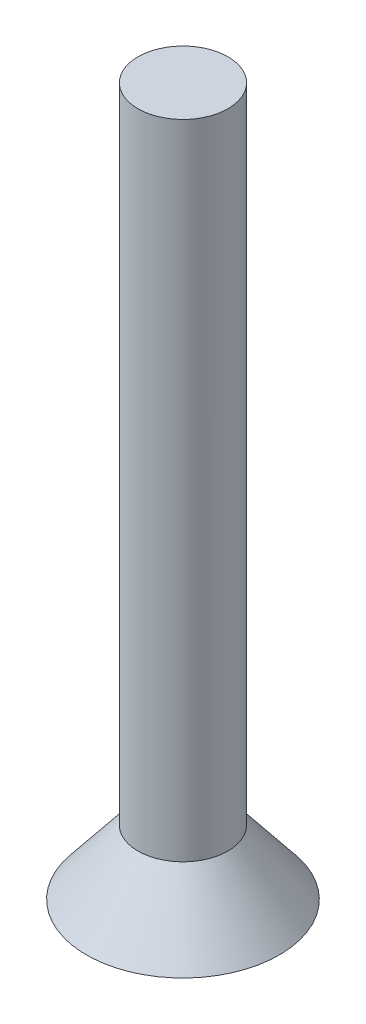
ISO-10303-21;
HEADER;
FILE_DESCRIPTION(('STEP AP214'),'2;1');
FILE_NAME('part.step','',(''),(''),'','','');
FILE_SCHEMA(('AUTOMOTIVE_DESIGN { 1 0 10303 214 1 1 1 1 }'));
ENDSEC;
DATA;
#1=APPLICATION_CONTEXT('core data for automotive mechanical design processes');
#2=APPLICATION_PROTOCOL_DEFINITION('international standard','automotive_design',2000,#1);
#3=PRODUCT_CONTEXT('',#1,'mechanical');
#4=PRODUCT('Part','Part','',(#3));
#5=PRODUCT_RELATED_PRODUCT_CATEGORY('part','',(#4));
#6=PRODUCT_DEFINITION_FORMATION('','',#4);
#7=PRODUCT_DEFINITION_CONTEXT('part definition',#1,'design');
#8=PRODUCT_DEFINITION('design','',#6,#7);
#9=PRODUCT_DEFINITION_SHAPE('','',#8);
#10=(LENGTH_UNIT() NAMED_UNIT(*) SI_UNIT(.MILLI.,.METRE.));
#11=(NAMED_UNIT(*) PLANE_ANGLE_UNIT() SI_UNIT($,.RADIAN.));
#12=(NAMED_UNIT(*) SI_UNIT($,.STERADIAN.) SOLID_ANGLE_UNIT());
#13=UNCERTAINTY_MEASURE_WITH_UNIT(LENGTH_MEASURE(1.E-05),#10,'distance_accuracy_value','');
#14=(GEOMETRIC_REPRESENTATION_CONTEXT(3) GLOBAL_UNCERTAINTY_ASSIGNED_CONTEXT((#13)) GLOBAL_UNIT_ASSIGNED_CONTEXT((#10,
#11,#12)) REPRESENTATION_CONTEXT('',''));
#15=CARTESIAN_POINT('',(0.,0.,0.));
#16=DIRECTION('',(0.,0.,1.));
#17=DIRECTION('',(1.,0.,0.));
#18=AXIS2_PLACEMENT_3D('',#15,#16,#17);
#19=CARTESIAN_POINT('',(0.,0.,0.));
#20=DIRECTION('',(0.,-1.,0.));
#21=DIRECTION('',(0.,0.,-1.));
#22=AXIS2_PLACEMENT_3D('',#19,#20,#21);
#23=CONICAL_SURFACE('',#22,1.5,0.674740942223554);
#24=CARTESIAN_POINT('',(0.,1.,0.));
#25=DIRECTION('',(0.,1.,0.));
#26=DIRECTION('',(0.,0.,1.));
#27=AXIS2_PLACEMENT_3D('',#24,#25,#26);
#28=CIRCLE('',#27,0.7);
#29=CARTESIAN_POINT('',(0.,1.,0.7));
#30=VERTEX_POINT('',#29);
#31=EDGE_CURVE('E212',#30,#30,#28,.T.);
#32=ORIENTED_EDGE('',*,*,#31,.F.);
#33=EDGE_LOOP('',(#32));
#34=FACE_BOUND('',#33,.T.);
#35=CARTESIAN_POINT('',(0.,0.,0.));
#36=DIRECTION('',(0.,-1.,0.));
#37=DIRECTION('',(0.,0.,-1.));
#38=AXIS2_PLACEMENT_3D('',#35,#36,#37);
#39=CIRCLE('',#38,1.5);
#40=CARTESIAN_POINT('',(0.,0.,-1.5));
#41=VERTEX_POINT('',#40);
#42=EDGE_CURVE('E11',#41,#41,#39,.T.);
#43=ORIENTED_EDGE('',*,*,#42,.F.);
#44=EDGE_LOOP('',(#43));
#45=FACE_BOUND('',#44,.T.);
#46=ADVANCED_FACE('F39',(#34,#45),#23,.T.);
#47=CARTESIAN_POINT('',(0.,0.,0.));
#48=DIRECTION('',(0.,-1.,0.));
#49=DIRECTION('',(0.,0.,-1.));
#50=AXIS2_PLACEMENT_3D('',#47,#48,#49);
#51=PLANE('',#50);
#52=DIRECTION('',(1.,0.,0.));
#53=VECTOR('',#52,1.);
#54=CARTESIAN_POINT('',(0.765105952763958,0.,-0.249999999999995));
#55=LINE('',#54,#53);
#56=CARTESIAN_POINT('',(0.250000000000001,0.,-0.249999999999998));
#57=VERTEX_POINT('',#56);
#58=CARTESIAN_POINT('',(0.765105952763958,0.,-0.249999999999995));
#59=VERTEX_POINT('',#58);
#60=EDGE_CURVE('E54',#57,#59,#55,.T.);
#61=ORIENTED_EDGE('',*,*,#60,.F.);
#62=DIRECTION('',(0.,0.,1.));
#63=VECTOR('',#62,1.);
#64=CARTESIAN_POINT('',(0.250000000000001,0.,-0.249999999999998));
#65=LINE('',#64,#63);
#66=CARTESIAN_POINT('',(0.250000000000003,0.,-0.765105952763955));
#67=VERTEX_POINT('',#66);
#68=EDGE_CURVE('E206',#67,#57,#65,.T.);
#69=ORIENTED_EDGE('',*,*,#68,.F.);
#70=DIRECTION('',(1.,0.,0.));
#71=VECTOR('',#70,1.);
#72=CARTESIAN_POINT('',(0.,0.,-0.765105952763956));
#73=LINE('',#72,#71);
#74=CARTESIAN_POINT('',(-0.249999999999997,0.,-0.765105952763957));
#75=VERTEX_POINT('',#74);
#76=EDGE_CURVE('E203',#75,#67,#73,.T.);
#77=ORIENTED_EDGE('',*,*,#76,.F.);
#78=DIRECTION('',(0.,0.,-1.));
#79=VECTOR('',#78,1.);
#80=CARTESIAN_POINT('',(-0.249999999999997,0.,-0.765105952763957));
#81=LINE('',#80,#79);
#82=CARTESIAN_POINT('',(-0.249999999999999,0.,-0.25));
#83=VERTEX_POINT('',#82);
#84=EDGE_CURVE('E138',#83,#75,#81,.T.);
#85=ORIENTED_EDGE('',*,*,#84,.F.);
#86=DIRECTION('',(1.,0.,0.));
#87=VECTOR('',#86,1.);
#88=CARTESIAN_POINT('',(-0.249999999999999,0.,-0.25));
#89=LINE('',#88,#87);
#90=CARTESIAN_POINT('',(-0.765105952763956,0.,-0.25));
#91=VERTEX_POINT('',#90);
#92=EDGE_CURVE('E197',#91,#83,#89,.T.);
#93=ORIENTED_EDGE('',*,*,#92,.F.);
#94=DIRECTION('',(0.,0.,-1.));
#95=VECTOR('',#94,1.);
#96=CARTESIAN_POINT('',(-0.765105952763956,0.,0.));
#97=LINE('',#96,#95);
#98=CARTESIAN_POINT('',(-0.765105952763956,0.,0.25));
#99=VERTEX_POINT('',#98);
#100=EDGE_CURVE('E193',#99,#91,#97,.T.);
#101=ORIENTED_EDGE('',*,*,#100,.F.);
#102=DIRECTION('',(-1.,0.,0.));
#103=VECTOR('',#102,1.);
#104=CARTESIAN_POINT('',(-0.765105952763956,0.,0.25));
#105=LINE('',#104,#103);
#106=CARTESIAN_POINT('',(-0.250000000000003,0.,0.25));
#107=VERTEX_POINT('',#106);
#108=EDGE_CURVE('E189',#107,#99,#105,.T.);
#109=ORIENTED_EDGE('',*,*,#108,.F.);
#110=DIRECTION('',(0.,0.,-1.));
#111=VECTOR('',#110,1.);
#112=CARTESIAN_POINT('',(-0.250000000000003,0.,0.25));
#113=LINE('',#112,#111);
#114=CARTESIAN_POINT('',(-0.250000000000008,0.,0.765105952763953));
#115=VERTEX_POINT('',#114);
#116=EDGE_CURVE('E185',#115,#107,#113,.T.);
#117=ORIENTED_EDGE('',*,*,#116,.F.);
#118=DIRECTION('',(-1.,0.,0.));
#119=VECTOR('',#118,1.);
#120=CARTESIAN_POINT('',(0.,0.,0.765105952763956));
#121=LINE('',#120,#119);
#122=CARTESIAN_POINT('',(0.249999999999992,0.,0.765105952763959));
#123=VERTEX_POINT('',#122);
#124=EDGE_CURVE('E181',#123,#115,#121,.T.);
#125=ORIENTED_EDGE('',*,*,#124,.F.);
#126=DIRECTION('',(0.,0.,1.));
#127=VECTOR('',#126,1.);
#128=CARTESIAN_POINT('',(0.249999999999992,0.,0.765105952763959));
#129=LINE('',#128,#127);
#130=CARTESIAN_POINT('',(0.249999999999997,0.,0.250000000000002));
#131=VERTEX_POINT('',#130);
#132=EDGE_CURVE('E177',#131,#123,#129,.T.);
#133=ORIENTED_EDGE('',*,*,#132,.F.);
#134=DIRECTION('',(-1.,0.,0.));
#135=VECTOR('',#134,1.);
#136=CARTESIAN_POINT('',(0.249999999999997,0.,0.250000000000002));
#137=LINE('',#136,#135);
#138=CARTESIAN_POINT('',(0.765105952763954,0.,0.250000000000005));
#139=VERTEX_POINT('',#138);
#140=EDGE_CURVE('E173',#139,#131,#137,.T.);
#141=ORIENTED_EDGE('',*,*,#140,.F.);
#142=DIRECTION('',(0.,0.,1.));
#143=VECTOR('',#142,1.);
#144=CARTESIAN_POINT('',(0.765105952763956,0.,0.));
#145=LINE('',#144,#143);
#146=EDGE_CURVE('E169',#59,#139,#145,.T.);
#147=ORIENTED_EDGE('',*,*,#146,.F.);
#148=EDGE_LOOP('',(#61,#69,#77,#85,#93,#101,#109,#117,#125,#133,#141,#147));
#149=FACE_BOUND('',#148,.T.);
#150=ORIENTED_EDGE('',*,*,#42,.T.);
#151=EDGE_LOOP('',(#150));
#152=FACE_BOUND('',#151,.T.);
#153=ADVANCED_FACE('F250',(#149,#152),#51,.T.);
#154=CARTESIAN_POINT('',(0.,11.,0.));
#155=DIRECTION('',(0.,-1.,0.));
#156=DIRECTION('',(0.,0.,-1.));
#157=AXIS2_PLACEMENT_3D('',#154,#155,#156);
#158=CYLINDRICAL_SURFACE('',#157,0.7);
#159=CARTESIAN_POINT('',(0.,11.,0.));
#160=DIRECTION('',(0.,1.,0.));
#161=DIRECTION('',(0.,0.,1.));
#162=AXIS2_PLACEMENT_3D('',#159,#160,#161);
#163=CIRCLE('',#162,0.7);
#164=CARTESIAN_POINT('',(0.,11.,0.7));
#165=VERTEX_POINT('',#164);
#166=EDGE_CURVE('E47',#165,#165,#163,.T.);
#167=ORIENTED_EDGE('',*,*,#166,.F.);
#168=EDGE_LOOP('',(#167));
#169=FACE_BOUND('',#168,.T.);
#170=ORIENTED_EDGE('',*,*,#31,.T.);
#171=EDGE_LOOP('',(#170));
#172=FACE_BOUND('',#171,.T.);
#173=ADVANCED_FACE('F246',(#169,#172),#158,.T.);
#174=CARTESIAN_POINT('',(0.,11.,0.));
#175=DIRECTION('',(0.,1.,0.));
#176=DIRECTION('',(0.,0.,1.));
#177=AXIS2_PLACEMENT_3D('',#174,#175,#176);
#178=PLANE('',#177);
#179=ORIENTED_EDGE('',*,*,#166,.T.);
#180=EDGE_LOOP('',(#179));
#181=FACE_BOUND('',#180,.T.);
#182=ADVANCED_FACE('F258',(#181),#178,.T.);
#183=CARTESIAN_POINT('',(0.765105952763958,0.3,-0.249999999999995));
#184=DIRECTION('',(0.,0.,-1.));
#185=DIRECTION('',(-1.,0.,0.));
#186=AXIS2_PLACEMENT_3D('',#183,#184,#185);
#187=PLANE('',#186);
#188=ORIENTED_EDGE('',*,*,#60,.T.);
#189=DIRECTION('',(0.,-1.,0.));
#190=VECTOR('',#189,1.);
#191=CARTESIAN_POINT('',(0.765105952763958,0.3,-0.249999999999995));
#192=LINE('',#191,#190);
#193=CARTESIAN_POINT('',(0.765105952763958,0.3,-0.249999999999995));
#194=VERTEX_POINT('',#193);
#195=EDGE_CURVE('E102',#194,#59,#192,.T.);
#196=ORIENTED_EDGE('',*,*,#195,.F.);
#197=DIRECTION('',(1.,0.,0.));
#198=VECTOR('',#197,1.);
#199=CARTESIAN_POINT('',(0.765105952763958,0.3,-0.249999999999995));
#200=LINE('',#199,#198);
#201=CARTESIAN_POINT('',(0.250000000000001,0.3,-0.249999999999998));
#202=VERTEX_POINT('',#201);
#203=EDGE_CURVE('E209',#202,#194,#200,.T.);
#204=ORIENTED_EDGE('',*,*,#203,.F.);
#205=DIRECTION('',(0.,-1.,0.));
#206=VECTOR('',#205,1.);
#207=CARTESIAN_POINT('',(0.250000000000001,0.3,-0.249999999999998));
#208=LINE('',#207,#206);
#209=EDGE_CURVE('E62',#202,#57,#208,.T.);
#210=ORIENTED_EDGE('',*,*,#209,.T.);
#211=EDGE_LOOP('',(#188,#196,#204,#210));
#212=FACE_BOUND('',#211,.T.);
#213=ADVANCED_FACE('F264',(#212),#187,.F.);
#214=CARTESIAN_POINT('',(0.250000000000001,0.3,-0.249999999999998));
#215=DIRECTION('',(1.,0.,0.));
#216=DIRECTION('',(0.,0.,-1.));
#217=AXIS2_PLACEMENT_3D('',#214,#215,#216);
#218=PLANE('',#217);
#219=ORIENTED_EDGE('',*,*,#68,.T.);
#220=ORIENTED_EDGE('',*,*,#209,.F.);
#221=DIRECTION('',(0.,0.,1.));
#222=VECTOR('',#221,1.);
#223=CARTESIAN_POINT('',(0.250000000000001,0.3,-0.249999999999998));
#224=LINE('',#223,#222);
#225=CARTESIAN_POINT('',(0.250000000000003,0.3,-0.765105952763955));
#226=VERTEX_POINT('',#225);
#227=EDGE_CURVE('E152',#226,#202,#224,.T.);
#228=ORIENTED_EDGE('',*,*,#227,.F.);
#229=DIRECTION('',(0.,-1.,0.));
#230=VECTOR('',#229,1.);
#231=CARTESIAN_POINT('',(0.250000000000003,0.3,-0.765105952763955));
#232=LINE('',#231,#230);
#233=EDGE_CURVE('E143',#226,#67,#232,.T.);
#234=ORIENTED_EDGE('',*,*,#233,.T.);
#235=EDGE_LOOP('',(#219,#220,#228,#234));
#236=FACE_BOUND('',#235,.T.);
#237=ADVANCED_FACE('F268',(#236),#218,.F.);
#238=CARTESIAN_POINT('',(0.,0.3,-0.765105952763956));
#239=DIRECTION('',(0.,0.,-1.));
#240=DIRECTION('',(-1.,0.,0.));
#241=AXIS2_PLACEMENT_3D('',#238,#239,#240);
#242=PLANE('',#241);
#243=ORIENTED_EDGE('',*,*,#76,.T.);
#244=ORIENTED_EDGE('',*,*,#233,.F.);
#245=DIRECTION('',(1.,0.,0.));
#246=VECTOR('',#245,1.);
#247=CARTESIAN_POINT('',(0.,0.3,-0.765105952763956));
#248=LINE('',#247,#246);
#249=CARTESIAN_POINT('',(-0.249999999999997,0.3,-0.765105952763957));
#250=VERTEX_POINT('',#249);
#251=EDGE_CURVE('E147',#250,#226,#248,.T.);
#252=ORIENTED_EDGE('',*,*,#251,.F.);
#253=DIRECTION('',(0.,-1.,0.));
#254=VECTOR('',#253,1.);
#255=CARTESIAN_POINT('',(-0.249999999999997,0.3,-0.765105952763957));
#256=LINE('',#255,#254);
#257=EDGE_CURVE('E131',#250,#75,#256,.T.);
#258=ORIENTED_EDGE('',*,*,#257,.T.);
#259=EDGE_LOOP('',(#243,#244,#252,#258));
#260=FACE_BOUND('',#259,.T.);
#261=ADVANCED_FACE('F148',(#260),#242,.F.);
#262=CARTESIAN_POINT('',(-0.249999999999997,0.3,-0.765105952763957));
#263=DIRECTION('',(-1.,0.,0.));
#264=DIRECTION('',(0.,0.,1.));
#265=AXIS2_PLACEMENT_3D('',#262,#263,#264);
#266=PLANE('',#265);
#267=ORIENTED_EDGE('',*,*,#84,.T.);
#268=ORIENTED_EDGE('',*,*,#257,.F.);
#269=DIRECTION('',(0.,0.,-1.));
#270=VECTOR('',#269,1.);
#271=CARTESIAN_POINT('',(-0.249999999999997,0.3,-0.765105952763957));
#272=LINE('',#271,#270);
#273=CARTESIAN_POINT('',(-0.249999999999999,0.3,-0.25));
#274=VERTEX_POINT('',#273);
#275=EDGE_CURVE('E135',#274,#250,#272,.T.);
#276=ORIENTED_EDGE('',*,*,#275,.F.);
#277=DIRECTION('',(0.,-1.,0.));
#278=VECTOR('',#277,1.);
#279=CARTESIAN_POINT('',(-0.249999999999999,0.3,-0.25));
#280=LINE('',#279,#278);
#281=EDGE_CURVE('E144',#274,#83,#280,.T.);
#282=ORIENTED_EDGE('',*,*,#281,.T.);
#283=EDGE_LOOP('',(#267,#268,#276,#282));
#284=FACE_BOUND('',#283,.T.);
#285=ADVANCED_FACE('F133',(#284),#266,.F.);
#286=CARTESIAN_POINT('',(-0.249999999999999,0.3,-0.25));
#287=DIRECTION('',(0.,0.,-1.));
#288=DIRECTION('',(-1.,0.,0.));
#289=AXIS2_PLACEMENT_3D('',#286,#287,#288);
#290=PLANE('',#289);
#291=ORIENTED_EDGE('',*,*,#92,.T.);
#292=ORIENTED_EDGE('',*,*,#281,.F.);
#293=DIRECTION('',(1.,0.,0.));
#294=VECTOR('',#293,1.);
#295=CARTESIAN_POINT('',(-0.249999999999999,0.3,-0.25));
#296=LINE('',#295,#294);
#297=CARTESIAN_POINT('',(-0.765105952763956,0.3,-0.25));
#298=VERTEX_POINT('',#297);
#299=EDGE_CURVE('E157',#298,#274,#296,.T.);
#300=ORIENTED_EDGE('',*,*,#299,.F.);
#301=DIRECTION('',(0.,-1.,0.));
#302=VECTOR('',#301,1.);
#303=CARTESIAN_POINT('',(-0.765105952763956,0.3,-0.25));
#304=LINE('',#303,#302);
#305=EDGE_CURVE('E217',#298,#91,#304,.T.);
#306=ORIENTED_EDGE('',*,*,#305,.T.);
#307=EDGE_LOOP('',(#291,#292,#300,#306));
#308=FACE_BOUND('',#307,.T.);
#309=ADVANCED_FACE('F296',(#308),#290,.F.);
#310=CARTESIAN_POINT('',(-0.765105952763956,0.3,0.));
#311=DIRECTION('',(-1.,0.,0.));
#312=DIRECTION('',(0.,0.,1.));
#313=AXIS2_PLACEMENT_3D('',#310,#311,#312);
#314=PLANE('',#313);
#315=ORIENTED_EDGE('',*,*,#100,.T.);
#316=ORIENTED_EDGE('',*,*,#305,.F.);
#317=DIRECTION('',(0.,0.,-1.));
#318=VECTOR('',#317,1.);
#319=CARTESIAN_POINT('',(-0.765105952763956,0.3,0.));
#320=LINE('',#319,#318);
#321=CARTESIAN_POINT('',(-0.765105952763956,0.3,0.25));
#322=VERTEX_POINT('',#321);
#323=EDGE_CURVE('E161',#322,#298,#320,.T.);
#324=ORIENTED_EDGE('',*,*,#323,.F.);
#325=DIRECTION('',(0.,-1.,0.));
#326=VECTOR('',#325,1.);
#327=CARTESIAN_POINT('',(-0.765105952763956,0.3,0.25));
#328=LINE('',#327,#326);
#329=EDGE_CURVE('E220',#322,#99,#328,.T.);
#330=ORIENTED_EDGE('',*,*,#329,.T.);
#331=EDGE_LOOP('',(#315,#316,#324,#330));
#332=FACE_BOUND('',#331,.T.);
#333=ADVANCED_FACE('F292',(#332),#314,.F.);
#334=CARTESIAN_POINT('',(-0.765105952763956,0.3,0.25));
#335=DIRECTION('',(0.,0.,1.));
#336=DIRECTION('',(1.,0.,0.));
#337=AXIS2_PLACEMENT_3D('',#334,#335,#336);
#338=PLANE('',#337);
#339=ORIENTED_EDGE('',*,*,#108,.T.);
#340=ORIENTED_EDGE('',*,*,#329,.F.);
#341=DIRECTION('',(-1.,0.,0.));
#342=VECTOR('',#341,1.);
#343=CARTESIAN_POINT('',(-0.765105952763956,0.3,0.25));
#344=LINE('',#343,#342);
#345=CARTESIAN_POINT('',(-0.250000000000003,0.3,0.25));
#346=VERTEX_POINT('',#345);
#347=EDGE_CURVE('E447',#346,#322,#344,.T.);
#348=ORIENTED_EDGE('',*,*,#347,.F.);
#349=DIRECTION('',(0.,-1.,0.));
#350=VECTOR('',#349,1.);
#351=CARTESIAN_POINT('',(-0.250000000000003,0.3,0.25));
#352=LINE('',#351,#350);
#353=EDGE_CURVE('E223',#346,#107,#352,.T.);
#354=ORIENTED_EDGE('',*,*,#353,.T.);
#355=EDGE_LOOP('',(#339,#340,#348,#354));
#356=FACE_BOUND('',#355,.T.);
#357=ADVANCED_FACE('F288',(#356),#338,.F.);
#358=CARTESIAN_POINT('',(-0.250000000000003,0.3,0.25));
#359=DIRECTION('',(-1.,0.,0.));
#360=DIRECTION('',(0.,0.,1.));
#361=AXIS2_PLACEMENT_3D('',#358,#359,#360);
#362=PLANE('',#361);
#363=ORIENTED_EDGE('',*,*,#116,.T.);
#364=ORIENTED_EDGE('',*,*,#353,.F.);
#365=DIRECTION('',(0.,0.,-1.));
#366=VECTOR('',#365,1.);
#367=CARTESIAN_POINT('',(-0.250000000000003,0.3,0.25));
#368=LINE('',#367,#366);
#369=CARTESIAN_POINT('',(-0.250000000000008,0.3,0.765105952763953));
#370=VERTEX_POINT('',#369);
#371=EDGE_CURVE('E443',#370,#346,#368,.T.);
#372=ORIENTED_EDGE('',*,*,#371,.F.);
#373=DIRECTION('',(0.,-1.,0.));
#374=VECTOR('',#373,1.);
#375=CARTESIAN_POINT('',(-0.250000000000008,0.3,0.765105952763953));
#376=LINE('',#375,#374);
#377=EDGE_CURVE('E226',#370,#115,#376,.T.);
#378=ORIENTED_EDGE('',*,*,#377,.T.);
#379=EDGE_LOOP('',(#363,#364,#372,#378));
#380=FACE_BOUND('',#379,.T.);
#381=ADVANCED_FACE('F284',(#380),#362,.F.);
#382=CARTESIAN_POINT('',(0.,0.3,0.765105952763956));
#383=DIRECTION('',(0.,0.,1.));
#384=DIRECTION('',(1.,0.,0.));
#385=AXIS2_PLACEMENT_3D('',#382,#383,#384);
#386=PLANE('',#385);
#387=ORIENTED_EDGE('',*,*,#124,.T.);
#388=ORIENTED_EDGE('',*,*,#377,.F.);
#389=DIRECTION('',(-1.,0.,0.));
#390=VECTOR('',#389,1.);
#391=CARTESIAN_POINT('',(0.,0.3,0.765105952763956));
#392=LINE('',#391,#390);
#393=CARTESIAN_POINT('',(0.249999999999992,0.3,0.765105952763959));
#394=VERTEX_POINT('',#393);
#395=EDGE_CURVE('E440',#394,#370,#392,.T.);
#396=ORIENTED_EDGE('',*,*,#395,.F.);
#397=DIRECTION('',(0.,-1.,0.));
#398=VECTOR('',#397,1.);
#399=CARTESIAN_POINT('',(0.249999999999992,0.3,0.765105952763959));
#400=LINE('',#399,#398);
#401=EDGE_CURVE('E229',#394,#123,#400,.T.);
#402=ORIENTED_EDGE('',*,*,#401,.T.);
#403=EDGE_LOOP('',(#387,#388,#396,#402));
#404=FACE_BOUND('',#403,.T.);
#405=ADVANCED_FACE('F280',(#404),#386,.F.);
#406=CARTESIAN_POINT('',(0.249999999999992,0.3,0.765105952763959));
#407=DIRECTION('',(1.,0.,0.));
#408=DIRECTION('',(0.,0.,-1.));
#409=AXIS2_PLACEMENT_3D('',#406,#407,#408);
#410=PLANE('',#409);
#411=ORIENTED_EDGE('',*,*,#132,.T.);
#412=ORIENTED_EDGE('',*,*,#401,.F.);
#413=DIRECTION('',(0.,0.,1.));
#414=VECTOR('',#413,1.);
#415=CARTESIAN_POINT('',(0.249999999999992,0.3,0.765105952763959));
#416=LINE('',#415,#414);
#417=CARTESIAN_POINT('',(0.249999999999997,0.3,0.250000000000002));
#418=VERTEX_POINT('',#417);
#419=EDGE_CURVE('E436',#418,#394,#416,.T.);
#420=ORIENTED_EDGE('',*,*,#419,.F.);
#421=DIRECTION('',(0.,-1.,0.));
#422=VECTOR('',#421,1.);
#423=CARTESIAN_POINT('',(0.249999999999997,0.3,0.250000000000002));
#424=LINE('',#423,#422);
#425=EDGE_CURVE('E232',#418,#131,#424,.T.);
#426=ORIENTED_EDGE('',*,*,#425,.T.);
#427=EDGE_LOOP('',(#411,#412,#420,#426));
#428=FACE_BOUND('',#427,.T.);
#429=ADVANCED_FACE('F276',(#428),#410,.F.);
#430=CARTESIAN_POINT('',(0.249999999999997,0.3,0.250000000000002));
#431=DIRECTION('',(0.,0.,1.));
#432=DIRECTION('',(1.,0.,0.));
#433=AXIS2_PLACEMENT_3D('',#430,#431,#432);
#434=PLANE('',#433);
#435=ORIENTED_EDGE('',*,*,#140,.T.);
#436=ORIENTED_EDGE('',*,*,#425,.F.);
#437=DIRECTION('',(-1.,0.,0.));
#438=VECTOR('',#437,1.);
#439=CARTESIAN_POINT('',(0.249999999999997,0.3,0.250000000000002));
#440=LINE('',#439,#438);
#441=CARTESIAN_POINT('',(0.765105952763954,0.3,0.250000000000005));
#442=VERTEX_POINT('',#441);
#443=EDGE_CURVE('E429',#442,#418,#440,.T.);
#444=ORIENTED_EDGE('',*,*,#443,.F.);
#445=DIRECTION('',(0.,-1.,0.));
#446=VECTOR('',#445,1.);
#447=CARTESIAN_POINT('',(0.765105952763954,0.3,0.250000000000005));
#448=LINE('',#447,#446);
#449=EDGE_CURVE('E235',#442,#139,#448,.T.);
#450=ORIENTED_EDGE('',*,*,#449,.T.);
#451=EDGE_LOOP('',(#435,#436,#444,#450));
#452=FACE_BOUND('',#451,.T.);
#453=ADVANCED_FACE('F272',(#452),#434,.F.);
#454=CARTESIAN_POINT('',(0.765105952763956,0.3,0.));
#455=DIRECTION('',(1.,0.,0.));
#456=DIRECTION('',(0.,0.,-1.));
#457=AXIS2_PLACEMENT_3D('',#454,#455,#456);
#458=PLANE('',#457);
#459=ORIENTED_EDGE('',*,*,#146,.T.);
#460=ORIENTED_EDGE('',*,*,#449,.F.);
#461=DIRECTION('',(0.,0.,1.));
#462=VECTOR('',#461,1.);
#463=CARTESIAN_POINT('',(0.765105952763956,0.3,0.));
#464=LINE('',#463,#462);
#465=EDGE_CURVE('E426',#194,#442,#464,.T.);
#466=ORIENTED_EDGE('',*,*,#465,.F.);
#467=ORIENTED_EDGE('',*,*,#195,.T.);
#468=EDGE_LOOP('',(#459,#460,#466,#467));
#469=FACE_BOUND('',#468,.T.);
#470=ADVANCED_FACE('F269',(#469),#458,.F.);
#471=CARTESIAN_POINT('',(0.,0.3,0.));
#472=DIRECTION('',(0.,-1.,0.));
#473=DIRECTION('',(0.,0.,-1.));
#474=AXIS2_PLACEMENT_3D('',#471,#472,#473);
#475=PLANE('',#474);
#476=ORIENTED_EDGE('',*,*,#203,.T.);
#477=ORIENTED_EDGE('',*,*,#465,.T.);
#478=ORIENTED_EDGE('',*,*,#443,.T.);
#479=ORIENTED_EDGE('',*,*,#419,.T.);
#480=ORIENTED_EDGE('',*,*,#395,.T.);
#481=ORIENTED_EDGE('',*,*,#371,.T.);
#482=ORIENTED_EDGE('',*,*,#347,.T.);
#483=ORIENTED_EDGE('',*,*,#323,.T.);
#484=ORIENTED_EDGE('',*,*,#299,.T.);
#485=ORIENTED_EDGE('',*,*,#275,.T.);
#486=ORIENTED_EDGE('',*,*,#251,.T.);
#487=ORIENTED_EDGE('',*,*,#227,.T.);
#488=EDGE_LOOP('',(#476,#477,#478,#479,#480,#481,#482,#483,#484,#485,#486,#487));
#489=FACE_BOUND('',#488,.T.);
#490=ADVANCED_FACE('F155',(#489),#475,.T.);
#491=CLOSED_SHELL('',(#46,#153,#173,#182,#213,#237,#261,#285,#309,#333,#357,#381,#405,#429,#453,
#470,#490));
#492=MANIFOLD_SOLID_BREP('B2',#491);
#493=ADVANCED_BREP_SHAPE_REPRESENTATION('',(#18,#492),#14);
#494=SHAPE_DEFINITION_REPRESENTATION(#9,#493);
ENDSEC;
END-ISO-10303-21;
